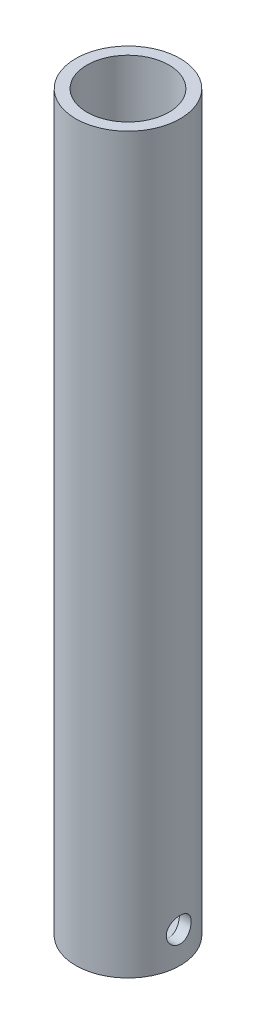
ISO-10303-21;
HEADER;
FILE_DESCRIPTION(('STEP AP214'),'2;1');
FILE_NAME('part.step','',(''),(''),'','','');
FILE_SCHEMA(('AUTOMOTIVE_DESIGN { 1 0 10303 214 1 1 1 1 }'));
ENDSEC;
DATA;
#1=APPLICATION_CONTEXT('core data for automotive mechanical design processes');
#2=APPLICATION_PROTOCOL_DEFINITION('international standard','automotive_design',2000,#1);
#3=PRODUCT_CONTEXT('',#1,'mechanical');
#4=PRODUCT('Part','Part','',(#3));
#5=PRODUCT_RELATED_PRODUCT_CATEGORY('part','',(#4));
#6=PRODUCT_DEFINITION_FORMATION('','',#4);
#7=PRODUCT_DEFINITION_CONTEXT('part definition',#1,'design');
#8=PRODUCT_DEFINITION('design','',#6,#7);
#9=PRODUCT_DEFINITION_SHAPE('','',#8);
#10=(LENGTH_UNIT() NAMED_UNIT(*) SI_UNIT(.MILLI.,.METRE.));
#11=(NAMED_UNIT(*) PLANE_ANGLE_UNIT() SI_UNIT($,.RADIAN.));
#12=(NAMED_UNIT(*) SI_UNIT($,.STERADIAN.) SOLID_ANGLE_UNIT());
#13=UNCERTAINTY_MEASURE_WITH_UNIT(LENGTH_MEASURE(1.E-05),#10,'distance_accuracy_value','');
#14=(GEOMETRIC_REPRESENTATION_CONTEXT(3) GLOBAL_UNCERTAINTY_ASSIGNED_CONTEXT((#13)) GLOBAL_UNIT_ASSIGNED_CONTEXT((#10,
#11,#12)) REPRESENTATION_CONTEXT('',''));
#15=CARTESIAN_POINT('',(0.,0.,0.));
#16=DIRECTION('',(0.,0.,1.));
#17=DIRECTION('',(1.,0.,0.));
#18=AXIS2_PLACEMENT_3D('',#15,#16,#17);
#19=CARTESIAN_POINT('',(0.,187.325,0.));
#20=DIRECTION('',(0.,1.,0.));
#21=DIRECTION('',(0.,0.,1.));
#22=AXIS2_PLACEMENT_3D('',#19,#20,#21);
#23=PLANE('',#22);
#24=CARTESIAN_POINT('',(0.,187.325,0.));
#25=DIRECTION('',(0.,1.,0.));
#26=DIRECTION('',(0.,0.,1.));
#27=AXIS2_PLACEMENT_3D('',#24,#25,#26);
#28=CIRCLE('',#27,13.335);
#29=CARTESIAN_POINT('',(0.,187.325,13.335));
#30=VERTEX_POINT('',#29);
#31=EDGE_CURVE('E47',#30,#30,#28,.T.);
#32=ORIENTED_EDGE('',*,*,#31,.T.);
#33=EDGE_LOOP('',(#32));
#34=FACE_BOUND('',#33,.T.);
#35=CARTESIAN_POINT('',(0.,187.325,0.));
#36=DIRECTION('',(0.,1.,0.));
#37=DIRECTION('',(0.,0.,1.));
#38=AXIS2_PLACEMENT_3D('',#35,#36,#37);
#39=CIRCLE('',#38,10.4648);
#40=CARTESIAN_POINT('',(0.,187.325,10.4648));
#41=VERTEX_POINT('',#40);
#42=EDGE_CURVE('E59',#41,#41,#39,.T.);
#43=ORIENTED_EDGE('',*,*,#42,.F.);
#44=EDGE_LOOP('',(#43));
#45=FACE_BOUND('',#44,.T.);
#46=ADVANCED_FACE('F39',(#34,#45),#23,.T.);
#47=CARTESIAN_POINT('',(0.,0.,0.));
#48=DIRECTION('',(0.,1.,0.));
#49=DIRECTION('',(0.,0.,1.));
#50=AXIS2_PLACEMENT_3D('',#47,#48,#49);
#51=PLANE('',#50);
#52=CARTESIAN_POINT('',(0.,0.,0.));
#53=DIRECTION('',(0.,1.,0.));
#54=DIRECTION('',(0.,0.,1.));
#55=AXIS2_PLACEMENT_3D('',#52,#53,#54);
#56=CIRCLE('',#55,13.335);
#57=CARTESIAN_POINT('',(0.,0.,13.335));
#58=VERTEX_POINT('',#57);
#59=EDGE_CURVE('E96',#58,#58,#56,.T.);
#60=ORIENTED_EDGE('',*,*,#59,.F.);
#61=EDGE_LOOP('',(#60));
#62=FACE_BOUND('',#61,.T.);
#63=ADVANCED_FACE('F84',(#62),#51,.F.);
#64=CARTESIAN_POINT('',(0.,187.325,0.));
#65=DIRECTION('',(0.,-1.,0.));
#66=DIRECTION('',(0.,0.,-1.));
#67=AXIS2_PLACEMENT_3D('',#64,#65,#66);
#68=CYLINDRICAL_SURFACE('',#67,13.335);
#69=CARTESIAN_POINT('',(12.9515095645257,7.93750000000001,-3.175));
#70=CARTESIAN_POINT('',(12.9515130431755,7.76189268882725,-3.17499456149958));
#71=CARTESIAN_POINT('',(12.9551200740808,7.58622324079254,-3.16038129676346));
#72=CARTESIAN_POINT('',(12.9691257629382,7.2399096076198,-3.10239586208023));
#73=CARTESIAN_POINT('',(12.9795287491152,7.06926869750206,-3.05900536414934));
#74=CARTESIAN_POINT('',(13.0058828751809,6.73807144948301,-2.9449335746023));
#75=CARTESIAN_POINT('',(13.0218272781896,6.57750314453768,-2.87428540958144));
#76=CARTESIAN_POINT('',(13.0574594405973,6.27048582845109,-2.70780239363046));
#77=CARTESIAN_POINT('',(13.0771472670241,6.12403707019792,-2.6119670917007));
#78=CARTESIAN_POINT('',(13.118487955002,5.84648963213899,-2.39578669769674));
#79=CARTESIAN_POINT('',(13.1401697933428,5.71571445719425,-2.275031731239));
#80=CARTESIAN_POINT('',(13.1828032471772,5.47606980049288,-2.01332346761705));
#81=CARTESIAN_POINT('',(13.2037547990051,5.36720222469192,-1.8723684148753));
#82=CARTESIAN_POINT('',(13.2428856684522,5.17315681873219,-1.57206341806933));
#83=CARTESIAN_POINT('',(13.2610268017373,5.08829418578503,-1.41250440071767));
#84=CARTESIAN_POINT('',(13.2921635256137,4.94671295929079,-1.08088354694045));
#85=CARTESIAN_POINT('',(13.3051598028521,4.88999060980535,-0.908823382583767));
#86=CARTESIAN_POINT('',(13.3243376708765,4.80732892912497,-0.560453733464587));
#87=CARTESIAN_POINT('',(13.3306405767352,4.78084092311206,-0.384281231879623));
#88=CARTESIAN_POINT('',(13.3361433296159,4.75768025143553,-0.0298879327775167));
#89=CARTESIAN_POINT('',(13.3353441328959,4.76100357184541,0.148332585758549));
#90=CARTESIAN_POINT('',(13.3268239897638,4.79697104212123,0.497966648337661));
#91=CARTESIAN_POINT('',(13.3192427776362,4.82902329674307,0.669444994786618));
#92=CARTESIAN_POINT('',(13.2981717176837,4.92059064106693,1.00451605305304));
#93=CARTESIAN_POINT('',(13.2846815726295,4.98010711227354,1.1681083677302));
#94=CARTESIAN_POINT('',(13.2530902860291,5.12540979006894,1.48435595195096));
#95=CARTESIAN_POINT('',(13.2349514401953,5.21141202366409,1.63690804508805));
#96=CARTESIAN_POINT('',(13.1960389427811,5.40708223465689,1.92562579910209));
#97=CARTESIAN_POINT('',(13.1752648716533,5.51675398237129,2.06178884397884));
#98=CARTESIAN_POINT('',(13.1327510700209,5.75984306728274,2.31739012492049));
#99=CARTESIAN_POINT('',(13.1110001555929,5.89377806633792,2.4363346715475));
#100=CARTESIAN_POINT('',(13.0694560402835,6.17992128646862,2.65017821938942));
#101=CARTESIAN_POINT('',(13.0496629143456,6.3321302065709,2.74507630032997));
#102=CARTESIAN_POINT('',(13.0142391582439,6.65140107980448,2.9084101584116));
#103=CARTESIAN_POINT('',(12.9986256984092,6.81852065192914,2.97673728499364));
#104=CARTESIAN_POINT('',(12.9735553540214,7.16233348581672,3.08417943263224));
#105=CARTESIAN_POINT('',(12.9640972895066,7.33902490566021,3.12330005265765));
#106=CARTESIAN_POINT('',(12.9526536037414,7.69241393255617,3.17042088350117));
#107=CARTESIAN_POINT('',(12.9504938045518,7.86900926929883,3.17914664706702));
#108=CARTESIAN_POINT('',(12.9534187520608,8.22113194331725,3.16720775994804));
#109=CARTESIAN_POINT('',(12.9585029000799,8.39665936764715,3.14654553804755));
#110=CARTESIAN_POINT('',(12.9751769200354,8.73903656787628,3.07705085024721));
#111=CARTESIAN_POINT('',(12.9866712723459,8.90597532843715,3.02863170601553));
#112=CARTESIAN_POINT('',(13.0147816768645,9.22936876910356,2.90545158987758));
#113=CARTESIAN_POINT('',(13.0313982912689,9.38582229610154,2.83068772636532));
#114=CARTESIAN_POINT('',(13.0682539584389,9.68690435837599,2.65539046463786));
#115=CARTESIAN_POINT('',(13.0885527493023,9.83126982607038,2.55441806406799));
#116=CARTESIAN_POINT('',(13.130334807601,10.1012743480044,2.33013260902021));
#117=CARTESIAN_POINT('',(13.1518182504637,10.2269106185032,2.20681623955644));
#118=CARTESIAN_POINT('',(13.1941329207867,10.4587806845595,1.93803169385745));
#119=CARTESIAN_POINT('',(13.2149386661668,10.564515385599,1.79212823662935));
#120=CARTESIAN_POINT('',(13.2530512846874,10.7499783434189,1.48421240082465));
#121=CARTESIAN_POINT('',(13.2703583346173,10.8297079143658,1.32220083680958));
#122=CARTESIAN_POINT('',(13.29941785029,10.9602397966152,0.987754847062244));
#123=CARTESIAN_POINT('',(13.3112086066186,11.0112420350679,0.815401933280339));
#124=CARTESIAN_POINT('',(13.3280739114212,11.0834824818145,0.464256981614204));
#125=CARTESIAN_POINT('',(13.3331496281747,11.1047258675776,0.285466069371488));
#126=CARTESIAN_POINT('',(13.3359703889066,11.1165772166538,-0.0687721336588589));
#127=CARTESIAN_POINT('',(13.3338924643413,11.1079249884183,-0.244193658483454));
#128=CARTESIAN_POINT('',(13.3230267372412,11.0619095065361,-0.59100612672257));
#129=CARTESIAN_POINT('',(13.3142391013424,11.024546965911,-0.762397170125288));
#130=CARTESIAN_POINT('',(13.2909632038767,10.9225523356285,-1.09558846328029));
#131=CARTESIAN_POINT('',(13.27650057029,10.8580427469593,-1.25742811833028));
#132=CARTESIAN_POINT('',(13.2434056848544,10.7036986547332,-1.56807577167177));
#133=CARTESIAN_POINT('',(13.2247729522858,10.6138612311296,-1.71688226477556));
#134=CARTESIAN_POINT('',(13.1848433880495,10.4090936009047,-2.00078845722472));
#135=CARTESIAN_POINT('',(13.1634968926615,10.2936540113695,-2.13551379588762));
#136=CARTESIAN_POINT('',(13.1207856218596,10.0419633547704,-2.38393226701744));
#137=CARTESIAN_POINT('',(13.0994208432258,9.90570713533028,-2.49762017701064));
#138=CARTESIAN_POINT('',(13.0586939534724,9.61354510158032,-2.70256579836446));
#139=CARTESIAN_POINT('',(13.0393706982401,9.45735219094554,-2.79342250524194));
#140=CARTESIAN_POINT('',(13.0054227494587,9.13147644693421,-2.94745148659029));
#141=CARTESIAN_POINT('',(12.9907944145069,8.96180419625138,-3.01064523050147));
#142=CARTESIAN_POINT('',(12.9703469124297,8.64977629273011,-3.09739525243156));
#143=CARTESIAN_POINT('',(12.9633335061891,8.50899851378259,-3.12643671616753));
#144=CARTESIAN_POINT('',(12.9539135690808,8.2246608782374,-3.16524064753339));
#145=CARTESIAN_POINT('',(12.9515067198927,8.08110121456494,-3.17500444728218));
#146=CARTESIAN_POINT('',(12.9515095645257,7.93750000000001,-3.175));
#147=B_SPLINE_CURVE_WITH_KNOTS('',3,(#69,#70,#71,#72,#73,#74,#75,#76,#77,#78,#79,#80,#81,#82,
#83,#84,#85,#86,#87,#88,#89,#90,#91,#92,#93,#94,#95,#96,#97,#98,#99,#100,#101,#102,#103,#104,
#105,#106,#107,#108,#109,#110,#111,#112,#113,#114,#115,#116,#117,#118,#119,#120,#121,#122,#123,
#124,#125,#126,#127,#128,#129,#130,#131,#132,#133,#134,#135,#136,#137,#138,#139,#140,#141,#142,
#143,#144,#145,#146),.UNSPECIFIED.,.T.,.F.,(4,2,2,2,2,2,2,2,2,2,2,2,2,2,2,2,2,2,2,2,2,2,2,2,2,2,
2,2,2,2,2,2,2,2,2,2,2,2,4),(0.,0.526295023569184,1.05292556242485,1.57891808620836,
2.10492002902979,2.6403837329889,3.17589400203578,3.71814000187963,4.26031360761066,
4.79248341941362,5.32458157863659,5.84596281603141,6.36737028279646,6.89314850855961,
7.41901054742838,7.95780562049121,8.49662131048932,9.03761765397032,9.57851026029277,
10.1063993133018,10.6342447411986,11.1544270735389,11.6746665190755,12.2042561691891,
12.7339244544748,13.2754877679726,13.8170237093841,14.3547427431345,14.8923682124687,
15.4167856696078,15.9411901032431,16.4632531169852,16.9853763440143,17.5190066122244,
18.0527691752265,18.5953378964269,19.13748477601,19.567887286663,19.9982600547402),.UNSPECIFIED.);
#148=CARTESIAN_POINT('',(12.9515095645257,7.93750000000001,-3.175));
#149=VERTEX_POINT('',#148);
#150=EDGE_CURVE('E56',#149,#149,#147,.T.);
#151=ORIENTED_EDGE('',*,*,#150,.T.);
#152=EDGE_LOOP('',(#151));
#153=FACE_BOUND('',#152,.T.);
#154=ORIENTED_EDGE('',*,*,#31,.F.);
#155=EDGE_LOOP('',(#154));
#156=FACE_BOUND('',#155,.T.);
#157=ORIENTED_EDGE('',*,*,#59,.T.);
#158=EDGE_LOOP('',(#157));
#159=FACE_BOUND('',#158,.T.);
#160=ADVANCED_FACE('F41',(#153,#156,#159),#68,.T.);
#161=CARTESIAN_POINT('',(0.,187.325,0.));
#162=DIRECTION('',(0.,-1.,0.));
#163=DIRECTION('',(0.,0.,-1.));
#164=AXIS2_PLACEMENT_3D('',#161,#162,#163);
#165=CYLINDRICAL_SURFACE('',#164,10.4648);
#166=CARTESIAN_POINT('',(0.,4.7625,0.));
#167=DIRECTION('',(0.,1.,0.));
#168=DIRECTION('',(0.,0.,1.));
#169=AXIS2_PLACEMENT_3D('',#166,#167,#168);
#170=CIRCLE('',#169,10.4648);
#171=CARTESIAN_POINT('',(10.4648,4.7625,0.));
#172=VERTEX_POINT('',#171);
#173=EDGE_CURVE('E11',#172,#172,#170,.T.);
#174=ORIENTED_EDGE('',*,*,#173,.F.);
#175=CARTESIAN_POINT('',(10.4648,4.76250000000006,0.));
#176=CARTESIAN_POINT('',(10.4647986617218,4.76250185842712,0.174085791757478));
#177=CARTESIAN_POINT('',(10.4604146425794,4.77686512225567,0.348190415023922));
#178=CARTESIAN_POINT('',(10.4433545477958,4.83379850489732,0.691323806841768));
#179=CARTESIAN_POINT('',(10.4306761598271,4.87637648953243,0.860351146185827));
#180=CARTESIAN_POINT('',(10.3984154074654,4.98818264351552,1.18833151160114));
#181=CARTESIAN_POINT('',(10.378843367622,5.05737097300262,1.34729918620782));
#182=CARTESIAN_POINT('',(10.3348259777607,5.22026879356979,1.65137692524628));
#183=CARTESIAN_POINT('',(10.3103799468613,5.31398171123177,1.79648504934778));
#184=CARTESIAN_POINT('',(10.2584178418927,5.52616055876816,2.07297592075699));
#185=CARTESIAN_POINT('',(10.2308377755757,5.64521444269747,2.20389541172417));
#186=CARTESIAN_POINT('',(10.1760947883233,5.90344293361309,2.44425040193427));
#187=CARTESIAN_POINT('',(10.1489319402852,6.04262101348486,2.5536821852851));
#188=CARTESIAN_POINT('',(10.0974192654073,6.34109122523633,2.75041301060926));
#189=CARTESIAN_POINT('',(10.0731488148408,6.50077339213418,2.83714305330425));
#190=CARTESIAN_POINT('',(10.0311269646774,6.83331172595715,2.98232870735195));
#191=CARTESIAN_POINT('',(10.0133739594642,7.00616463549339,3.04079128371099));
#192=CARTESIAN_POINT('',(9.98706459368089,7.35492887493694,3.12610537194363));
#193=CARTESIAN_POINT('',(9.97825995433705,7.53061170157847,3.15381236621464));
#194=CARTESIAN_POINT('',(9.97010600364055,7.88433585599487,3.17950049187145));
#195=CARTESIAN_POINT('',(9.97075434232142,8.06237658661052,3.17748901113061));
#196=CARTESIAN_POINT('',(9.98121328790726,8.40877392246993,3.14446846693764));
#197=CARTESIAN_POINT('',(9.99068391016447,8.57724506726895,3.11453536253537));
#198=CARTESIAN_POINT('',(10.0171696823831,8.90665180894169,3.02826130050455));
#199=CARTESIAN_POINT('',(10.0341855922242,9.06758664503469,2.97191768306232));
#200=CARTESIAN_POINT('',(10.0741131026089,9.37996575471936,2.83363827217465));
#201=CARTESIAN_POINT('',(10.097103619497,9.53124636100499,2.75135650870513));
#202=CARTESIAN_POINT('',(10.1463524361709,9.81821142857714,2.5637768928088));
#203=CARTESIAN_POINT('',(10.1726115426453,9.95389202381989,2.45847335373298));
#204=CARTESIAN_POINT('',(10.2268136386414,10.2119029461903,2.22251280965219));
#205=CARTESIAN_POINT('',(10.2547806155465,10.333414208801,2.09096414657381));
#206=CARTESIAN_POINT('',(10.3082534288056,10.552844410645,1.80900855193586));
#207=CARTESIAN_POINT('',(10.333759103062,10.6507617966566,1.65860037981585));
#208=CARTESIAN_POINT('',(10.3796775718903,10.8207374100734,1.34168261077194));
#209=CARTESIAN_POINT('',(10.400053556332,10.8926102741263,1.17506790455786));
#210=CARTESIAN_POINT('',(10.4331514492843,11.0070701840569,0.83135313538734));
#211=CARTESIAN_POINT('',(10.4458755431414,11.0496655919457,0.654256082029784));
#212=CARTESIAN_POINT('',(10.4618887330504,11.1029893760117,0.301563956616356));
#213=CARTESIAN_POINT('',(10.4655062406643,11.1148274839687,0.126151326625974));
#214=CARTESIAN_POINT('',(10.4638642470164,11.1094160024323,-0.224167411145478));
#215=CARTESIAN_POINT('',(10.4586059605044,11.0921703933651,-0.399073584958945));
#216=CARTESIAN_POINT('',(10.4400184163769,11.0299766406311,-0.739201309539025));
#217=CARTESIAN_POINT('',(10.426879133646,10.9856801288615,-0.904553382813671));
#218=CARTESIAN_POINT('',(10.3940546944459,10.8714289730228,-1.22543973823902));
#219=CARTESIAN_POINT('',(10.374368744878,10.8014712201062,-1.38097282814729));
#220=CARTESIAN_POINT('',(10.3299109622227,10.6360412197459,-1.68186432003312));
#221=CARTESIAN_POINT('',(10.3050305702973,10.5400084851842,-1.82689809280926));
#222=CARTESIAN_POINT('',(10.2530373765631,10.3258332811227,-2.09916844652685));
#223=CARTESIAN_POINT('',(10.2259240037326,10.2076851463418,-2.22640045258005));
#224=CARTESIAN_POINT('',(10.1712550560922,9.94741727304899,-2.464363252041));
#225=CARTESIAN_POINT('',(10.1437205543807,9.80456926545414,-2.57430409133572));
#226=CARTESIAN_POINT('',(10.0923936224058,9.50185329836794,-2.76871370657528));
#227=CARTESIAN_POINT('',(10.0686011034926,9.34198574223078,-2.85318308599833));
#228=CARTESIAN_POINT('',(10.0277236290392,9.01023297385871,-2.99368686315083));
#229=CARTESIAN_POINT('',(10.0106087955503,8.83840544267917,-3.04984825668389));
#230=CARTESIAN_POINT('',(9.98513227972216,8.48711344129599,-3.13226262752658));
#231=CARTESIAN_POINT('',(9.97676751037823,8.30765168769958,-3.15852615303149));
#232=CARTESIAN_POINT('',(9.97004707736549,7.95440567240055,-3.17967114892858));
#233=CARTESIAN_POINT('',(9.97127998720401,7.78070545573613,-3.17584251831101));
#234=CARTESIAN_POINT('',(9.98262405408681,7.43654814284413,-3.1400002339761));
#235=CARTESIAN_POINT('',(9.99273484032714,7.26609091146996,-3.10798775741866));
#236=CARTESIAN_POINT('',(10.0204163124529,6.93541981283287,-3.01752759267743));
#237=CARTESIAN_POINT('',(10.0378883515011,6.7751016196512,-2.95942882906993));
#238=CARTESIAN_POINT('',(10.0783036079247,6.46636030738403,-2.81871769240387));
#239=CARTESIAN_POINT('',(10.1012478905067,6.31793951172631,-2.73610054592254));
#240=CARTESIAN_POINT('',(10.1510863731292,6.03123924091538,-2.54510423755544));
#241=CARTESIAN_POINT('',(10.1780956633422,5.89354151179637,-2.43588189296317));
#242=CARTESIAN_POINT('',(10.2324700801367,5.63801079926892,-2.19628414234308));
#243=CARTESIAN_POINT('',(10.2598352980599,5.52018302792568,-2.06590320377427));
#244=CARTESIAN_POINT('',(10.312827143881,5.30419376067238,-1.78295800224454));
#245=CARTESIAN_POINT('',(10.3383765210939,5.2067319681544,-1.6298436147307));
#246=CARTESIAN_POINT('',(10.3839193332026,5.03906833153374,-1.30862720541263));
#247=CARTESIAN_POINT('',(10.4039152558968,4.96885427555859,-1.14053193936208));
#248=CARTESIAN_POINT('',(10.4344464505852,4.86365510958336,-0.811682738488881));
#249=CARTESIAN_POINT('',(10.4457337009742,4.82582645615598,-0.651904186876151));
#250=CARTESIAN_POINT('',(10.4609104548398,4.77525023425308,-0.328088827928718));
#251=CARTESIAN_POINT('',(10.4648012611497,4.76249824867897,-0.164052775684678));
#252=CARTESIAN_POINT('',(10.4648,4.76250000000006,0.));
#253=B_SPLINE_CURVE_WITH_KNOTS('',3,(#175,#176,#177,#178,#179,#180,#181,#182,#183,#184,#185,
#186,#187,#188,#189,#190,#191,#192,#193,#194,#195,#196,#197,#198,#199,#200,#201,#202,#203,#204,
#205,#206,#207,#208,#209,#210,#211,#212,#213,#214,#215,#216,#217,#218,#219,#220,#221,#222,#223,
#224,#225,#226,#227,#228,#229,#230,#231,#232,#233,#234,#235,#236,#237,#238,#239,#240,#241,#242,
#243,#244,#245,#246,#247,#248,#249,#250,#251,#252),.UNSPECIFIED.,.T.,.F.,(4,2,2,2,2,2,2,2,2,2,2,
2,2,2,2,2,2,2,2,2,2,2,2,2,2,2,2,2,2,2,2,2,2,2,2,2,2,2,4),(0.,0.521654664621892,1.04345481960682,
1.5644767799574,2.08557157653573,2.62041771611716,3.15535626590974,3.70263889078639,
4.24978659830421,4.78130086235867,5.31268299668646,5.8243986179154,6.33616578531226,
6.85507048073545,7.3741034968259,7.91533299088818,8.45659810520282,9.00164315554423,
9.54653246937937,10.071470162541,10.5963360180418,11.1090314157861,11.6217889468671,
12.1465854532631,12.6715165807236,13.2159759600474,13.7604224388462,14.3024041743159,
14.8441946351869,15.3628920799563,15.8815678612216,16.3935035828454,16.9055390374144,
17.4366004088074,17.9678008663295,18.5150102132336,19.0619740281945,19.5536509939671,
20.0452413461499),.UNSPECIFIED.);
#254=EDGE_CURVE('E51',#172,#172,#253,.T.);
#255=ORIENTED_EDGE('',*,*,#254,.F.);
#256=EDGE_LOOP('',(#174,#255));
#257=FACE_BOUND('',#256,.T.);
#258=ORIENTED_EDGE('',*,*,#42,.T.);
#259=EDGE_LOOP('',(#258));
#260=FACE_BOUND('',#259,.T.);
#261=ADVANCED_FACE('F70',(#257,#260),#165,.F.);
#262=CARTESIAN_POINT('',(0.,4.7625,0.));
#263=DIRECTION('',(0.,1.,0.));
#264=DIRECTION('',(0.,0.,1.));
#265=AXIS2_PLACEMENT_3D('',#262,#263,#264);
#266=PLANE('',#265);
#267=ORIENTED_EDGE('',*,*,#173,.T.);
#268=EDGE_LOOP('',(#267));
#269=FACE_BOUND('',#268,.T.);
#270=ADVANCED_FACE('F76',(#269),#266,.T.);
#271=CARTESIAN_POINT('',(-1.016,7.93750000000001,0.));
#272=DIRECTION('',(1.,0.,0.));
#273=DIRECTION('',(0.,0.,-1.));
#274=AXIS2_PLACEMENT_3D('',#271,#272,#273);
#275=CYLINDRICAL_SURFACE('',#274,3.175);
#276=ORIENTED_EDGE('',*,*,#254,.T.);
#277=EDGE_LOOP('',(#276));
#278=FACE_BOUND('',#277,.T.);
#279=ORIENTED_EDGE('',*,*,#150,.F.);
#280=EDGE_LOOP('',(#279));
#281=FACE_BOUND('',#280,.T.);
#282=ADVANCED_FACE('F52',(#278,#281),#275,.F.);
#283=CLOSED_SHELL('',(#46,#63,#160,#261,#270,#282));
#284=MANIFOLD_SOLID_BREP('B2',#283);
#285=ADVANCED_BREP_SHAPE_REPRESENTATION('',(#18,#284),#14);
#286=SHAPE_DEFINITION_REPRESENTATION(#9,#285);
ENDSEC;
END-ISO-10303-21;
